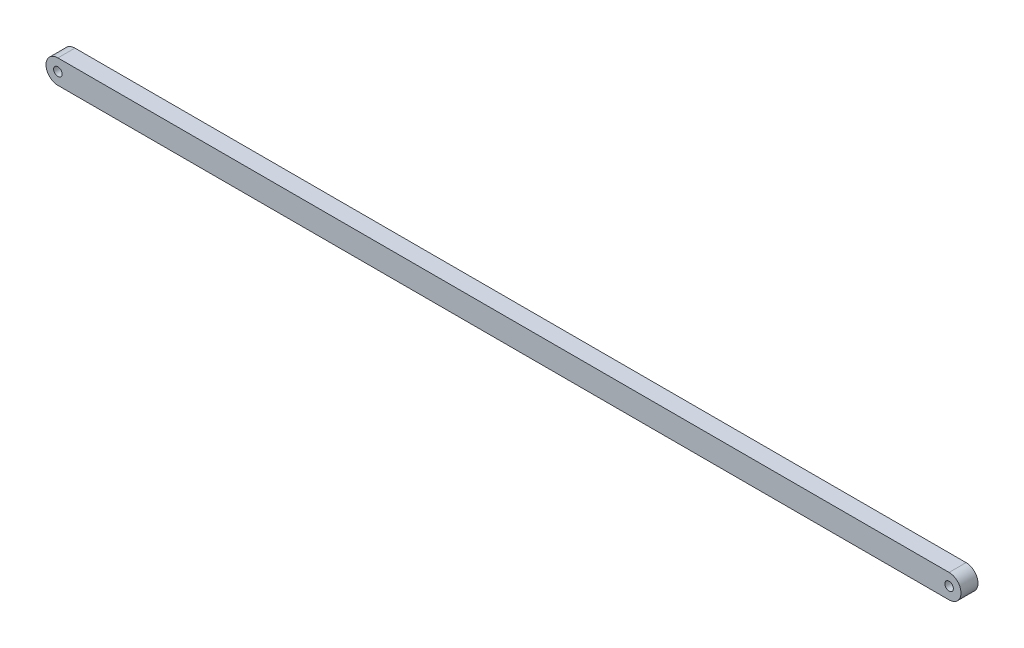
ISO-10303-21;
HEADER;
FILE_DESCRIPTION(('STEP AP214'),'2;1');
FILE_NAME('part.step','',(''),(''),'','','');
FILE_SCHEMA(('AUTOMOTIVE_DESIGN { 1 0 10303 214 1 1 1 1 }'));
ENDSEC;
DATA;
#1=APPLICATION_CONTEXT('core data for automotive mechanical design processes');
#2=APPLICATION_PROTOCOL_DEFINITION('international standard','automotive_design',2000,#1);
#3=PRODUCT_CONTEXT('',#1,'mechanical');
#4=PRODUCT('Part','Part','',(#3));
#5=PRODUCT_RELATED_PRODUCT_CATEGORY('part','',(#4));
#6=PRODUCT_DEFINITION_FORMATION('','',#4);
#7=PRODUCT_DEFINITION_CONTEXT('part definition',#1,'design');
#8=PRODUCT_DEFINITION('design','',#6,#7);
#9=PRODUCT_DEFINITION_SHAPE('','',#8);
#10=(LENGTH_UNIT() NAMED_UNIT(*) SI_UNIT(.MILLI.,.METRE.));
#11=(NAMED_UNIT(*) PLANE_ANGLE_UNIT() SI_UNIT($,.RADIAN.));
#12=(NAMED_UNIT(*) SI_UNIT($,.STERADIAN.) SOLID_ANGLE_UNIT());
#13=UNCERTAINTY_MEASURE_WITH_UNIT(LENGTH_MEASURE(1.E-05),#10,'distance_accuracy_value','');
#14=(GEOMETRIC_REPRESENTATION_CONTEXT(3) GLOBAL_UNCERTAINTY_ASSIGNED_CONTEXT((#13)) GLOBAL_UNIT_ASSIGNED_CONTEXT((#10,
#11,#12)) REPRESENTATION_CONTEXT('',''));
#15=CARTESIAN_POINT('',(0.,0.,0.));
#16=DIRECTION('',(0.,0.,1.));
#17=DIRECTION('',(1.,0.,0.));
#18=AXIS2_PLACEMENT_3D('',#15,#16,#17);
#19=CARTESIAN_POINT('',(0.,0.,5.));
#20=DIRECTION('',(0.,0.,1.));
#21=DIRECTION('',(1.,0.,0.));
#22=AXIS2_PLACEMENT_3D('',#19,#20,#21);
#23=PLANE('',#22);
#24=CARTESIAN_POINT('',(0.,0.,5.));
#25=DIRECTION('',(0.,0.,1.));
#26=DIRECTION('',(1.,0.,0.));
#27=AXIS2_PLACEMENT_3D('',#24,#25,#26);
#28=CIRCLE('',#27,2.5);
#29=CARTESIAN_POINT('',(2.5,0.,5.));
#30=VERTEX_POINT('',#29);
#31=EDGE_CURVE('E118',#30,#30,#28,.T.);
#32=ORIENTED_EDGE('',*,*,#31,.F.);
#33=EDGE_LOOP('',(#32));
#34=FACE_BOUND('',#33,.T.);
#35=CARTESIAN_POINT('',(0.,0.,5.));
#36=DIRECTION('',(0.,0.,1.));
#37=DIRECTION('',(1.,0.,0.));
#38=AXIS2_PLACEMENT_3D('',#35,#36,#37);
#39=CIRCLE('',#38,7.);
#40=CARTESIAN_POINT('',(0.,7.,5.));
#41=VERTEX_POINT('',#40);
#42=CARTESIAN_POINT('',(0.,-7.,5.));
#43=VERTEX_POINT('',#42);
#44=EDGE_CURVE('E98',#41,#43,#39,.T.);
#45=ORIENTED_EDGE('',*,*,#44,.T.);
#46=DIRECTION('',(1.,0.,0.));
#47=VECTOR('',#46,1.);
#48=CARTESIAN_POINT('',(0.,-7.,5.));
#49=LINE('',#48,#47);
#50=CARTESIAN_POINT('',(524.,-7.,5.));
#51=VERTEX_POINT('',#50);
#52=EDGE_CURVE('E93',#43,#51,#49,.T.);
#53=ORIENTED_EDGE('',*,*,#52,.T.);
#54=CARTESIAN_POINT('',(524.,0.,5.));
#55=DIRECTION('',(0.,0.,1.));
#56=DIRECTION('',(1.,0.,0.));
#57=AXIS2_PLACEMENT_3D('',#54,#55,#56);
#58=CIRCLE('',#57,7.);
#59=CARTESIAN_POINT('',(524.,7.,5.));
#60=VERTEX_POINT('',#59);
#61=EDGE_CURVE('E96',#51,#60,#58,.T.);
#62=ORIENTED_EDGE('',*,*,#61,.T.);
#63=DIRECTION('',(-1.,0.,0.));
#64=VECTOR('',#63,1.);
#65=CARTESIAN_POINT('',(0.,7.,5.));
#66=LINE('',#65,#64);
#67=EDGE_CURVE('E63',#60,#41,#66,.T.);
#68=ORIENTED_EDGE('',*,*,#67,.T.);
#69=EDGE_LOOP('',(#45,#53,#62,#68));
#70=FACE_BOUND('',#69,.T.);
#71=CARTESIAN_POINT('',(524.,0.,5.));
#72=DIRECTION('',(0.,0.,1.));
#73=DIRECTION('',(1.,0.,0.));
#74=AXIS2_PLACEMENT_3D('',#71,#72,#73);
#75=CIRCLE('',#74,2.49999999999991);
#76=CARTESIAN_POINT('',(526.5,0.,5.));
#77=VERTEX_POINT('',#76);
#78=EDGE_CURVE('E140',#77,#77,#75,.T.);
#79=ORIENTED_EDGE('',*,*,#78,.F.);
#80=EDGE_LOOP('',(#79));
#81=FACE_BOUND('',#80,.T.);
#82=ADVANCED_FACE('F45',(#34,#70,#81),#23,.T.);
#83=CARTESIAN_POINT('',(0.,0.,-5.));
#84=DIRECTION('',(0.,0.,1.));
#85=DIRECTION('',(1.,0.,0.));
#86=AXIS2_PLACEMENT_3D('',#83,#84,#85);
#87=PLANE('',#86);
#88=CARTESIAN_POINT('',(0.,0.,-5.));
#89=DIRECTION('',(0.,0.,1.));
#90=DIRECTION('',(1.,0.,0.));
#91=AXIS2_PLACEMENT_3D('',#88,#89,#90);
#92=CIRCLE('',#91,7.);
#93=CARTESIAN_POINT('',(0.,7.,-5.));
#94=VERTEX_POINT('',#93);
#95=CARTESIAN_POINT('',(0.,-7.,-5.));
#96=VERTEX_POINT('',#95);
#97=EDGE_CURVE('E114',#94,#96,#92,.T.);
#98=ORIENTED_EDGE('',*,*,#97,.F.);
#99=DIRECTION('',(-1.,0.,0.));
#100=VECTOR('',#99,1.);
#101=CARTESIAN_POINT('',(0.,7.,-5.));
#102=LINE('',#101,#100);
#103=CARTESIAN_POINT('',(524.,7.,-5.));
#104=VERTEX_POINT('',#103);
#105=EDGE_CURVE('E86',#104,#94,#102,.T.);
#106=ORIENTED_EDGE('',*,*,#105,.F.);
#107=CARTESIAN_POINT('',(524.,0.,-5.));
#108=DIRECTION('',(0.,0.,1.));
#109=DIRECTION('',(1.,0.,0.));
#110=AXIS2_PLACEMENT_3D('',#107,#108,#109);
#111=CIRCLE('',#110,7.);
#112=CARTESIAN_POINT('',(524.,-7.,-5.));
#113=VERTEX_POINT('',#112);
#114=EDGE_CURVE('E80',#113,#104,#111,.T.);
#115=ORIENTED_EDGE('',*,*,#114,.F.);
#116=DIRECTION('',(1.,0.,0.));
#117=VECTOR('',#116,1.);
#118=CARTESIAN_POINT('',(0.,-7.,-5.));
#119=LINE('',#118,#117);
#120=EDGE_CURVE('E103',#96,#113,#119,.T.);
#121=ORIENTED_EDGE('',*,*,#120,.F.);
#122=EDGE_LOOP('',(#98,#106,#115,#121));
#123=FACE_BOUND('',#122,.T.);
#124=CARTESIAN_POINT('',(0.,0.,-5.));
#125=DIRECTION('',(0.,0.,1.));
#126=DIRECTION('',(1.,0.,0.));
#127=AXIS2_PLACEMENT_3D('',#124,#125,#126);
#128=CIRCLE('',#127,2.5);
#129=CARTESIAN_POINT('',(2.5,0.,-5.));
#130=VERTEX_POINT('',#129);
#131=EDGE_CURVE('E136',#130,#130,#128,.T.);
#132=ORIENTED_EDGE('',*,*,#131,.T.);
#133=EDGE_LOOP('',(#132));
#134=FACE_BOUND('',#133,.T.);
#135=CARTESIAN_POINT('',(524.,0.,-5.));
#136=DIRECTION('',(0.,0.,1.));
#137=DIRECTION('',(1.,0.,0.));
#138=AXIS2_PLACEMENT_3D('',#135,#136,#137);
#139=CIRCLE('',#138,2.49999999999991);
#140=CARTESIAN_POINT('',(526.5,0.,-5.));
#141=VERTEX_POINT('',#140);
#142=EDGE_CURVE('E144',#141,#141,#139,.T.);
#143=ORIENTED_EDGE('',*,*,#142,.T.);
#144=EDGE_LOOP('',(#143));
#145=FACE_BOUND('',#144,.T.);
#146=ADVANCED_FACE('F131',(#123,#134,#145),#87,.F.);
#147=CARTESIAN_POINT('',(0.,0.,5.));
#148=DIRECTION('',(0.,0.,-1.));
#149=DIRECTION('',(-1.,0.,0.));
#150=AXIS2_PLACEMENT_3D('',#147,#148,#149);
#151=CYLINDRICAL_SURFACE('',#150,7.);
#152=ORIENTED_EDGE('',*,*,#97,.T.);
#153=DIRECTION('',(0.,0.,-1.));
#154=VECTOR('',#153,1.);
#155=CARTESIAN_POINT('',(0.,-7.,5.));
#156=LINE('',#155,#154);
#157=EDGE_CURVE('E11',#43,#96,#156,.T.);
#158=ORIENTED_EDGE('',*,*,#157,.F.);
#159=ORIENTED_EDGE('',*,*,#44,.F.);
#160=DIRECTION('',(0.,0.,-1.));
#161=VECTOR('',#160,1.);
#162=CARTESIAN_POINT('',(0.,7.,5.));
#163=LINE('',#162,#161);
#164=EDGE_CURVE('E110',#41,#94,#163,.T.);
#165=ORIENTED_EDGE('',*,*,#164,.T.);
#166=EDGE_LOOP('',(#152,#158,#159,#165));
#167=FACE_BOUND('',#166,.T.);
#168=ADVANCED_FACE('F47',(#167),#151,.T.);
#169=CARTESIAN_POINT('',(0.,-7.,5.));
#170=DIRECTION('',(0.,1.,0.));
#171=DIRECTION('',(0.,0.,1.));
#172=AXIS2_PLACEMENT_3D('',#169,#170,#171);
#173=PLANE('',#172);
#174=ORIENTED_EDGE('',*,*,#120,.T.);
#175=DIRECTION('',(0.,0.,-1.));
#176=VECTOR('',#175,1.);
#177=CARTESIAN_POINT('',(524.,-7.,5.));
#178=LINE('',#177,#176);
#179=EDGE_CURVE('E55',#51,#113,#178,.T.);
#180=ORIENTED_EDGE('',*,*,#179,.F.);
#181=ORIENTED_EDGE('',*,*,#52,.F.);
#182=ORIENTED_EDGE('',*,*,#157,.T.);
#183=EDGE_LOOP('',(#174,#180,#181,#182));
#184=FACE_BOUND('',#183,.T.);
#185=ADVANCED_FACE('F102',(#184),#173,.F.);
#186=CARTESIAN_POINT('',(524.,0.,5.));
#187=DIRECTION('',(0.,0.,-1.));
#188=DIRECTION('',(-1.,0.,0.));
#189=AXIS2_PLACEMENT_3D('',#186,#187,#188);
#190=CYLINDRICAL_SURFACE('',#189,7.);
#191=ORIENTED_EDGE('',*,*,#114,.T.);
#192=DIRECTION('',(0.,0.,-1.));
#193=VECTOR('',#192,1.);
#194=CARTESIAN_POINT('',(524.,7.,5.));
#195=LINE('',#194,#193);
#196=EDGE_CURVE('E105',#60,#104,#195,.T.);
#197=ORIENTED_EDGE('',*,*,#196,.F.);
#198=ORIENTED_EDGE('',*,*,#61,.F.);
#199=ORIENTED_EDGE('',*,*,#179,.T.);
#200=EDGE_LOOP('',(#191,#197,#198,#199));
#201=FACE_BOUND('',#200,.T.);
#202=ADVANCED_FACE('F106',(#201),#190,.T.);
#203=CARTESIAN_POINT('',(0.,7.,5.));
#204=DIRECTION('',(0.,-1.,0.));
#205=DIRECTION('',(0.,0.,-1.));
#206=AXIS2_PLACEMENT_3D('',#203,#204,#205);
#207=PLANE('',#206);
#208=ORIENTED_EDGE('',*,*,#105,.T.);
#209=ORIENTED_EDGE('',*,*,#164,.F.);
#210=ORIENTED_EDGE('',*,*,#67,.F.);
#211=ORIENTED_EDGE('',*,*,#196,.T.);
#212=EDGE_LOOP('',(#208,#209,#210,#211));
#213=FACE_BOUND('',#212,.T.);
#214=ADVANCED_FACE('F128',(#213),#207,.F.);
#215=CARTESIAN_POINT('',(0.,0.,5.));
#216=DIRECTION('',(0.,0.,-1.));
#217=DIRECTION('',(-1.,0.,0.));
#218=AXIS2_PLACEMENT_3D('',#215,#216,#217);
#219=CYLINDRICAL_SURFACE('',#218,2.5);
#220=ORIENTED_EDGE('',*,*,#31,.T.);
#221=EDGE_LOOP('',(#220));
#222=FACE_BOUND('',#221,.T.);
#223=ORIENTED_EDGE('',*,*,#131,.F.);
#224=EDGE_LOOP('',(#223));
#225=FACE_BOUND('',#224,.T.);
#226=ADVANCED_FACE('F163',(#222,#225),#219,.F.);
#227=CARTESIAN_POINT('',(524.,0.,5.));
#228=DIRECTION('',(0.,0.,-1.));
#229=DIRECTION('',(-1.,0.,0.));
#230=AXIS2_PLACEMENT_3D('',#227,#228,#229);
#231=CYLINDRICAL_SURFACE('',#230,2.49999999999991);
#232=ORIENTED_EDGE('',*,*,#78,.T.);
#233=EDGE_LOOP('',(#232));
#234=FACE_BOUND('',#233,.T.);
#235=ORIENTED_EDGE('',*,*,#142,.F.);
#236=EDGE_LOOP('',(#235));
#237=FACE_BOUND('',#236,.T.);
#238=ADVANCED_FACE('F152',(#234,#237),#231,.F.);
#239=CLOSED_SHELL('',(#82,#146,#168,#185,#202,#214,#226,#238));
#240=MANIFOLD_SOLID_BREP('B2',#239);
#241=ADVANCED_BREP_SHAPE_REPRESENTATION('',(#18,#240),#14);
#242=SHAPE_DEFINITION_REPRESENTATION(#9,#241);
ENDSEC;
END-ISO-10303-21;
